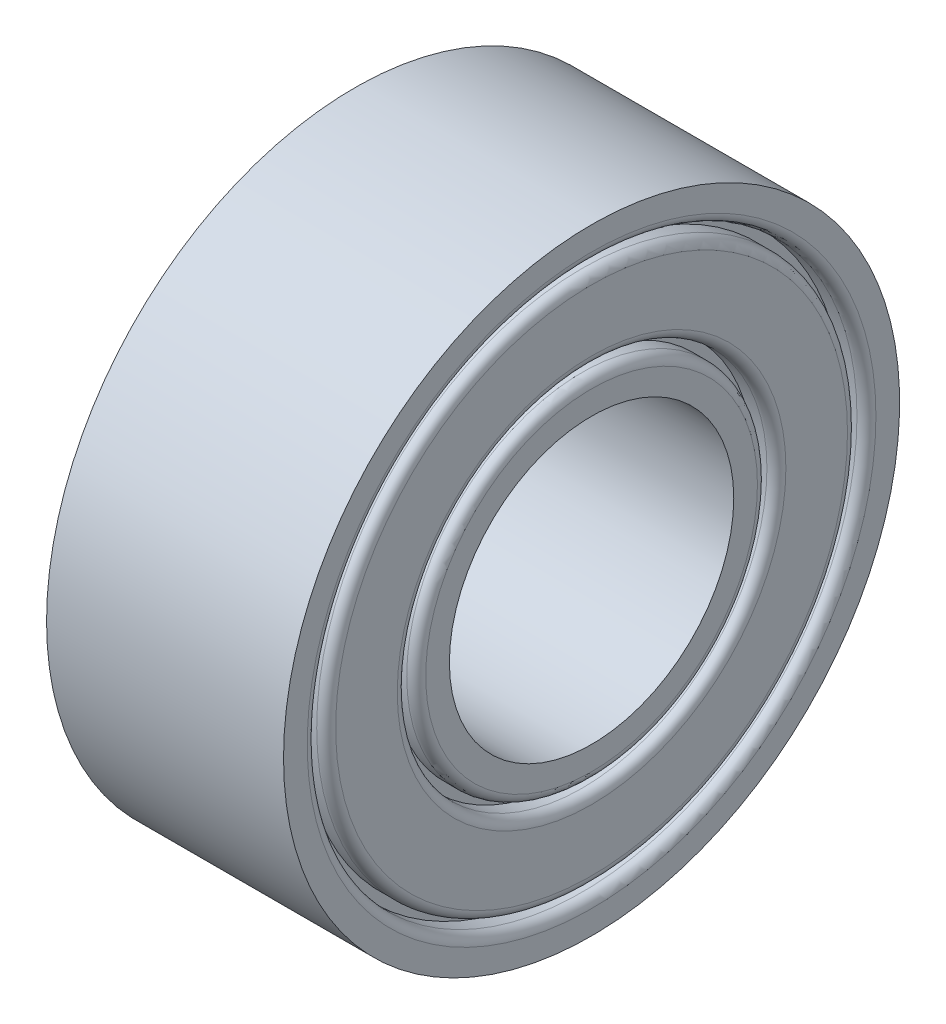
ISO-10303-21;
HEADER;
FILE_DESCRIPTION(('STEP AP214'),'2;1');
FILE_NAME('part.step','',(''),(''),'','','');
FILE_SCHEMA(('AUTOMOTIVE_DESIGN { 1 0 10303 214 1 1 1 1 }'));
ENDSEC;
DATA;
#1=APPLICATION_CONTEXT('core data for automotive mechanical design processes');
#2=APPLICATION_PROTOCOL_DEFINITION('international standard','automotive_design',2000,#1);
#3=PRODUCT_CONTEXT('',#1,'mechanical');
#4=PRODUCT('Part','Part','',(#3));
#5=PRODUCT_RELATED_PRODUCT_CATEGORY('part','',(#4));
#6=PRODUCT_DEFINITION_FORMATION('','',#4);
#7=PRODUCT_DEFINITION_CONTEXT('part definition',#1,'design');
#8=PRODUCT_DEFINITION('design','',#6,#7);
#9=PRODUCT_DEFINITION_SHAPE('','',#8);
#10=(LENGTH_UNIT() NAMED_UNIT(*) SI_UNIT(.MILLI.,.METRE.));
#11=(NAMED_UNIT(*) PLANE_ANGLE_UNIT() SI_UNIT($,.RADIAN.));
#12=(NAMED_UNIT(*) SI_UNIT($,.STERADIAN.) SOLID_ANGLE_UNIT());
#13=UNCERTAINTY_MEASURE_WITH_UNIT(LENGTH_MEASURE(1.E-05),#10,'distance_accuracy_value','');
#14=(GEOMETRIC_REPRESENTATION_CONTEXT(3) GLOBAL_UNCERTAINTY_ASSIGNED_CONTEXT((#13)) GLOBAL_UNIT_ASSIGNED_CONTEXT((#10,
#11,#12)) REPRESENTATION_CONTEXT('',''));
#15=CARTESIAN_POINT('',(0.,0.,0.));
#16=DIRECTION('',(0.,0.,1.));
#17=DIRECTION('',(1.,0.,0.));
#18=AXIS2_PLACEMENT_3D('',#15,#16,#17);
#19=CARTESIAN_POINT('',(2.5,0.,0.));
#20=DIRECTION('',(-1.,0.,0.));
#21=DIRECTION('',(0.,0.,1.));
#22=AXIS2_PLACEMENT_3D('',#19,#20,#21);
#23=CYLINDRICAL_SURFACE('',#22,3.);
#24=CARTESIAN_POINT('',(-2.5,0.,0.));
#25=DIRECTION('',(-1.,0.,0.));
#26=DIRECTION('',(0.,0.,1.));
#27=AXIS2_PLACEMENT_3D('',#24,#25,#26);
#28=CIRCLE('',#27,3.);
#29=CARTESIAN_POINT('',(-2.5,0.,3.));
#30=VERTEX_POINT('',#29);
#31=EDGE_CURVE('E17',#30,#30,#28,.F.);
#32=ORIENTED_EDGE('',*,*,#31,.F.);
#33=EDGE_LOOP('',(#32));
#34=FACE_BOUND('',#33,.T.);
#35=CARTESIAN_POINT('',(2.5,0.,0.));
#36=DIRECTION('',(-1.,0.,0.));
#37=DIRECTION('',(0.,0.,1.));
#38=AXIS2_PLACEMENT_3D('',#35,#36,#37);
#39=CIRCLE('',#38,3.);
#40=CARTESIAN_POINT('',(2.5,0.,3.));
#41=VERTEX_POINT('',#40);
#42=EDGE_CURVE('E61',#41,#41,#39,.T.);
#43=ORIENTED_EDGE('',*,*,#42,.F.);
#44=EDGE_LOOP('',(#43));
#45=FACE_BOUND('',#44,.T.);
#46=ADVANCED_FACE('F14',(#34,#45),#23,.F.);
#47=CARTESIAN_POINT('',(-2.5,3.5,0.));
#48=DIRECTION('',(-1.,0.,0.));
#49=DIRECTION('',(0.,0.,1.));
#50=AXIS2_PLACEMENT_3D('',#47,#48,#49);
#51=PLANE('',#50);
#52=CARTESIAN_POINT('',(-2.5,0.,0.));
#53=DIRECTION('',(1.,0.,0.));
#54=DIRECTION('',(0.,0.,-1.));
#55=AXIS2_PLACEMENT_3D('',#52,#53,#54);
#56=CIRCLE('',#55,3.50000000298023);
#57=CARTESIAN_POINT('',(-2.5,0.,-3.50000000298023));
#58=VERTEX_POINT('',#57);
#59=EDGE_CURVE('E63',#58,#58,#56,.T.);
#60=ORIENTED_EDGE('',*,*,#59,.F.);
#61=EDGE_LOOP('',(#60));
#62=FACE_BOUND('',#61,.T.);
#63=ORIENTED_EDGE('',*,*,#31,.T.);
#64=EDGE_LOOP('',(#63));
#65=FACE_BOUND('',#64,.T.);
#66=ADVANCED_FACE('F71',(#62,#65),#51,.T.);
#67=CARTESIAN_POINT('',(2.5,3.,0.));
#68=DIRECTION('',(1.,0.,0.));
#69=DIRECTION('',(0.,0.,-1.));
#70=AXIS2_PLACEMENT_3D('',#67,#68,#69);
#71=PLANE('',#70);
#72=ORIENTED_EDGE('',*,*,#42,.T.);
#73=EDGE_LOOP('',(#72));
#74=FACE_BOUND('',#73,.T.);
#75=CARTESIAN_POINT('',(2.5,0.,0.));
#76=DIRECTION('',(-1.,0.,0.));
#77=DIRECTION('',(0.,0.,-1.));
#78=AXIS2_PLACEMENT_3D('',#75,#76,#77);
#79=CIRCLE('',#78,3.5);
#80=CARTESIAN_POINT('',(2.5,0.,-3.5));
#81=VERTEX_POINT('',#80);
#82=EDGE_CURVE('E67',#81,#81,#79,.T.);
#83=ORIENTED_EDGE('',*,*,#82,.F.);
#84=EDGE_LOOP('',(#83));
#85=FACE_BOUND('',#84,.T.);
#86=ADVANCED_FACE('F79',(#74,#85),#71,.T.);
#87=CARTESIAN_POINT('',(-2.3,0.,0.));
#88=DIRECTION('',(1.,0.,0.));
#89=DIRECTION('',(0.,0.,-1.));
#90=AXIS2_PLACEMENT_3D('',#87,#88,#89);
#91=TOROIDAL_SURFACE('',#90,3.5,0.2);
#92=CARTESIAN_POINT('',(-2.3,0.,0.));
#93=DIRECTION('',(-1.,0.,0.));
#94=DIRECTION('',(0.,0.,1.));
#95=AXIS2_PLACEMENT_3D('',#92,#93,#94);
#96=CIRCLE('',#95,3.7);
#97=CARTESIAN_POINT('',(-2.3,0.,3.7));
#98=VERTEX_POINT('',#97);
#99=EDGE_CURVE('E286',#98,#98,#96,.F.);
#100=ORIENTED_EDGE('',*,*,#99,.F.);
#101=EDGE_LOOP('',(#100));
#102=FACE_BOUND('',#101,.T.);
#103=ORIENTED_EDGE('',*,*,#59,.T.);
#104=EDGE_LOOP('',(#103));
#105=FACE_BOUND('',#104,.T.);
#106=ADVANCED_FACE('F303',(#102,#105),#91,.T.);
#107=CARTESIAN_POINT('',(2.3,0.,0.));
#108=DIRECTION('',(1.,0.,0.));
#109=DIRECTION('',(0.,0.,-1.));
#110=AXIS2_PLACEMENT_3D('',#107,#108,#109);
#111=TOROIDAL_SURFACE('',#110,3.5,0.2);
#112=ORIENTED_EDGE('',*,*,#82,.T.);
#113=EDGE_LOOP('',(#112));
#114=FACE_BOUND('',#113,.T.);
#115=CARTESIAN_POINT('',(2.3,0.,0.));
#116=DIRECTION('',(-1.,0.,0.));
#117=DIRECTION('',(0.,0.,1.));
#118=AXIS2_PLACEMENT_3D('',#115,#116,#117);
#119=CIRCLE('',#118,3.7);
#120=CARTESIAN_POINT('',(2.3,0.,3.7));
#121=VERTEX_POINT('',#120);
#122=EDGE_CURVE('E60',#121,#121,#119,.T.);
#123=ORIENTED_EDGE('',*,*,#122,.F.);
#124=EDGE_LOOP('',(#123));
#125=FACE_BOUND('',#124,.T.);
#126=ADVANCED_FACE('F298',(#114,#125),#111,.T.);
#127=CARTESIAN_POINT('',(2.5,0.,0.));
#128=DIRECTION('',(-1.,0.,0.));
#129=DIRECTION('',(0.,0.,1.));
#130=AXIS2_PLACEMENT_3D('',#127,#128,#129);
#131=CYLINDRICAL_SURFACE('',#130,3.7);
#132=CARTESIAN_POINT('',(-2.,0.,0.));
#133=DIRECTION('',(-1.,0.,0.));
#134=DIRECTION('',(0.,0.,1.));
#135=AXIS2_PLACEMENT_3D('',#132,#133,#134);
#136=CIRCLE('',#135,3.7);
#137=CARTESIAN_POINT('',(-2.,0.,3.7));
#138=VERTEX_POINT('',#137);
#139=EDGE_CURVE('E58',#138,#138,#136,.F.);
#140=ORIENTED_EDGE('',*,*,#139,.F.);
#141=EDGE_LOOP('',(#140));
#142=FACE_BOUND('',#141,.T.);
#143=ORIENTED_EDGE('',*,*,#99,.T.);
#144=EDGE_LOOP('',(#143));
#145=FACE_BOUND('',#144,.T.);
#146=ADVANCED_FACE('F302',(#142,#145),#131,.T.);
#147=CARTESIAN_POINT('',(2.5,0.,0.));
#148=DIRECTION('',(-1.,0.,0.));
#149=DIRECTION('',(0.,0.,1.));
#150=AXIS2_PLACEMENT_3D('',#147,#148,#149);
#151=CYLINDRICAL_SURFACE('',#150,3.7);
#152=ORIENTED_EDGE('',*,*,#122,.T.);
#153=EDGE_LOOP('',(#152));
#154=FACE_BOUND('',#153,.T.);
#155=CARTESIAN_POINT('',(2.,0.,0.));
#156=DIRECTION('',(-1.,0.,0.));
#157=DIRECTION('',(0.,0.,1.));
#158=AXIS2_PLACEMENT_3D('',#155,#156,#157);
#159=CIRCLE('',#158,3.7);
#160=CARTESIAN_POINT('',(2.,0.,3.7));
#161=VERTEX_POINT('',#160);
#162=EDGE_CURVE('E55',#161,#161,#159,.T.);
#163=ORIENTED_EDGE('',*,*,#162,.F.);
#164=EDGE_LOOP('',(#163));
#165=FACE_BOUND('',#164,.T.);
#166=ADVANCED_FACE('F344',(#154,#165),#151,.T.);
#167=CARTESIAN_POINT('',(-2.,3.9,0.));
#168=DIRECTION('',(-1.,0.,0.));
#169=DIRECTION('',(0.,0.,1.));
#170=AXIS2_PLACEMENT_3D('',#167,#168,#169);
#171=PLANE('',#170);
#172=CARTESIAN_POINT('',(-2.,0.,0.));
#173=DIRECTION('',(-1.,0.,0.));
#174=DIRECTION('',(0.,0.,1.));
#175=AXIS2_PLACEMENT_3D('',#172,#173,#174);
#176=CIRCLE('',#175,3.9);
#177=CARTESIAN_POINT('',(-2.,0.,3.9));
#178=VERTEX_POINT('',#177);
#179=EDGE_CURVE('E52',#178,#178,#176,.T.);
#180=ORIENTED_EDGE('',*,*,#179,.T.);
#181=EDGE_LOOP('',(#180));
#182=FACE_BOUND('',#181,.T.);
#183=ORIENTED_EDGE('',*,*,#139,.T.);
#184=EDGE_LOOP('',(#183));
#185=FACE_BOUND('',#184,.T.);
#186=ADVANCED_FACE('F347',(#182,#185),#171,.T.);
#187=CARTESIAN_POINT('',(2.,3.7,0.));
#188=DIRECTION('',(1.,0.,0.));
#189=DIRECTION('',(0.,0.,-1.));
#190=AXIS2_PLACEMENT_3D('',#187,#188,#189);
#191=PLANE('',#190);
#192=ORIENTED_EDGE('',*,*,#162,.T.);
#193=EDGE_LOOP('',(#192));
#194=FACE_BOUND('',#193,.T.);
#195=CARTESIAN_POINT('',(2.,0.,0.));
#196=DIRECTION('',(-1.,0.,0.));
#197=DIRECTION('',(0.,0.,1.));
#198=AXIS2_PLACEMENT_3D('',#195,#196,#197);
#199=CIRCLE('',#198,3.9);
#200=CARTESIAN_POINT('',(2.,0.,3.9));
#201=VERTEX_POINT('',#200);
#202=EDGE_CURVE('E48',#201,#201,#199,.F.);
#203=ORIENTED_EDGE('',*,*,#202,.T.);
#204=EDGE_LOOP('',(#203));
#205=FACE_BOUND('',#204,.T.);
#206=ADVANCED_FACE('F350',(#194,#205),#191,.T.);
#207=CARTESIAN_POINT('',(2.5,0.,0.));
#208=DIRECTION('',(-1.,0.,0.));
#209=DIRECTION('',(0.,0.,1.));
#210=AXIS2_PLACEMENT_3D('',#207,#208,#209);
#211=CYLINDRICAL_SURFACE('',#210,3.9);
#212=CARTESIAN_POINT('',(-2.3,0.,0.));
#213=DIRECTION('',(1.,0.,0.));
#214=DIRECTION('',(0.,0.,-1.));
#215=AXIS2_PLACEMENT_3D('',#212,#213,#214);
#216=CIRCLE('',#215,3.9);
#217=CARTESIAN_POINT('',(-2.3,0.,-3.9));
#218=VERTEX_POINT('',#217);
#219=EDGE_CURVE('E51',#218,#218,#216,.T.);
#220=ORIENTED_EDGE('',*,*,#219,.F.);
#221=EDGE_LOOP('',(#220));
#222=FACE_BOUND('',#221,.T.);
#223=ORIENTED_EDGE('',*,*,#179,.F.);
#224=EDGE_LOOP('',(#223));
#225=FACE_BOUND('',#224,.T.);
#226=ADVANCED_FACE('F353',(#222,#225),#211,.F.);
#227=CARTESIAN_POINT('',(2.5,0.,0.));
#228=DIRECTION('',(-1.,0.,0.));
#229=DIRECTION('',(0.,0.,1.));
#230=AXIS2_PLACEMENT_3D('',#227,#228,#229);
#231=CYLINDRICAL_SURFACE('',#230,3.9);
#232=ORIENTED_EDGE('',*,*,#202,.F.);
#233=EDGE_LOOP('',(#232));
#234=FACE_BOUND('',#233,.T.);
#235=CARTESIAN_POINT('',(2.3,0.,0.));
#236=DIRECTION('',(1.,0.,0.));
#237=DIRECTION('',(0.,0.,-1.));
#238=AXIS2_PLACEMENT_3D('',#235,#236,#237);
#239=CIRCLE('',#238,3.9);
#240=CARTESIAN_POINT('',(2.3,0.,-3.9));
#241=VERTEX_POINT('',#240);
#242=EDGE_CURVE('E246',#241,#241,#239,.F.);
#243=ORIENTED_EDGE('',*,*,#242,.F.);
#244=EDGE_LOOP('',(#243));
#245=FACE_BOUND('',#244,.T.);
#246=ADVANCED_FACE('F271',(#234,#245),#231,.F.);
#247=CARTESIAN_POINT('',(-2.3,0.,0.));
#248=DIRECTION('',(1.,0.,0.));
#249=DIRECTION('',(0.,0.,-1.));
#250=AXIS2_PLACEMENT_3D('',#247,#248,#249);
#251=TOROIDAL_SURFACE('',#250,4.1,0.200000000000001);
#252=CARTESIAN_POINT('',(-2.5,0.,0.));
#253=DIRECTION('',(-1.,0.,0.));
#254=DIRECTION('',(0.,0.,-1.));
#255=AXIS2_PLACEMENT_3D('',#252,#253,#254);
#256=CIRCLE('',#255,4.1);
#257=CARTESIAN_POINT('',(-2.5,0.,-4.1));
#258=VERTEX_POINT('',#257);
#259=EDGE_CURVE('E201',#258,#258,#256,.F.);
#260=ORIENTED_EDGE('',*,*,#259,.F.);
#261=EDGE_LOOP('',(#260));
#262=FACE_BOUND('',#261,.T.);
#263=ORIENTED_EDGE('',*,*,#219,.T.);
#264=EDGE_LOOP('',(#263));
#265=FACE_BOUND('',#264,.T.);
#266=ADVANCED_FACE('F267',(#262,#265),#251,.T.);
#267=CARTESIAN_POINT('',(2.3,0.,0.));
#268=DIRECTION('',(1.,0.,0.));
#269=DIRECTION('',(0.,0.,-1.));
#270=AXIS2_PLACEMENT_3D('',#267,#268,#269);
#271=TOROIDAL_SURFACE('',#270,4.1,0.200000000000001);
#272=ORIENTED_EDGE('',*,*,#242,.T.);
#273=EDGE_LOOP('',(#272));
#274=FACE_BOUND('',#273,.T.);
#275=CARTESIAN_POINT('',(2.5,0.,0.));
#276=DIRECTION('',(1.,0.,0.));
#277=DIRECTION('',(0.,0.,-1.));
#278=AXIS2_PLACEMENT_3D('',#275,#276,#277);
#279=CIRCLE('',#278,4.1);
#280=CARTESIAN_POINT('',(2.5,0.,-4.1));
#281=VERTEX_POINT('',#280);
#282=EDGE_CURVE('E255',#281,#281,#279,.F.);
#283=ORIENTED_EDGE('',*,*,#282,.F.);
#284=EDGE_LOOP('',(#283));
#285=FACE_BOUND('',#284,.T.);
#286=ADVANCED_FACE('F218',(#274,#285),#271,.T.);
#287=CARTESIAN_POINT('',(-2.5,5.4,0.));
#288=DIRECTION('',(-1.,0.,0.));
#289=DIRECTION('',(0.,0.,1.));
#290=AXIS2_PLACEMENT_3D('',#287,#288,#289);
#291=PLANE('',#290);
#292=CARTESIAN_POINT('',(-2.5,0.,0.));
#293=DIRECTION('',(1.,0.,0.));
#294=DIRECTION('',(0.,0.,-1.));
#295=AXIS2_PLACEMENT_3D('',#292,#293,#294);
#296=CIRCLE('',#295,5.4);
#297=CARTESIAN_POINT('',(-2.5,0.,-5.4));
#298=VERTEX_POINT('',#297);
#299=EDGE_CURVE('E236',#298,#298,#296,.T.);
#300=ORIENTED_EDGE('',*,*,#299,.F.);
#301=EDGE_LOOP('',(#300));
#302=FACE_BOUND('',#301,.T.);
#303=ORIENTED_EDGE('',*,*,#259,.T.);
#304=EDGE_LOOP('',(#303));
#305=FACE_BOUND('',#304,.T.);
#306=ADVANCED_FACE('F208',(#302,#305),#291,.T.);
#307=CARTESIAN_POINT('',(2.5,4.1,0.));
#308=DIRECTION('',(1.,0.,0.));
#309=DIRECTION('',(0.,0.,-1.));
#310=AXIS2_PLACEMENT_3D('',#307,#308,#309);
#311=PLANE('',#310);
#312=ORIENTED_EDGE('',*,*,#282,.T.);
#313=EDGE_LOOP('',(#312));
#314=FACE_BOUND('',#313,.T.);
#315=CARTESIAN_POINT('',(2.5,0.,0.));
#316=DIRECTION('',(-1.,0.,0.));
#317=DIRECTION('',(0.,0.,-1.));
#318=AXIS2_PLACEMENT_3D('',#315,#316,#317);
#319=CIRCLE('',#318,5.4);
#320=CARTESIAN_POINT('',(2.5,0.,-5.4));
#321=VERTEX_POINT('',#320);
#322=EDGE_CURVE('E166',#321,#321,#319,.T.);
#323=ORIENTED_EDGE('',*,*,#322,.F.);
#324=EDGE_LOOP('',(#323));
#325=FACE_BOUND('',#324,.T.);
#326=ADVANCED_FACE('F217',(#314,#325),#311,.T.);
#327=CARTESIAN_POINT('',(-2.3,0.,0.));
#328=DIRECTION('',(1.,0.,0.));
#329=DIRECTION('',(0.,0.,-1.));
#330=AXIS2_PLACEMENT_3D('',#327,#328,#329);
#331=TOROIDAL_SURFACE('',#330,5.4,0.200000000000001);
#332=CARTESIAN_POINT('',(-2.3,0.,0.));
#333=DIRECTION('',(-1.,0.,0.));
#334=DIRECTION('',(0.,0.,1.));
#335=AXIS2_PLACEMENT_3D('',#332,#333,#334);
#336=CIRCLE('',#335,5.6);
#337=CARTESIAN_POINT('',(-2.3,0.,5.6));
#338=VERTEX_POINT('',#337);
#339=EDGE_CURVE('E161',#338,#338,#336,.F.);
#340=ORIENTED_EDGE('',*,*,#339,.F.);
#341=EDGE_LOOP('',(#340));
#342=FACE_BOUND('',#341,.T.);
#343=ORIENTED_EDGE('',*,*,#299,.T.);
#344=EDGE_LOOP('',(#343));
#345=FACE_BOUND('',#344,.T.);
#346=ADVANCED_FACE('F180',(#342,#345),#331,.T.);
#347=CARTESIAN_POINT('',(2.3,0.,0.));
#348=DIRECTION('',(1.,0.,0.));
#349=DIRECTION('',(0.,0.,-1.));
#350=AXIS2_PLACEMENT_3D('',#347,#348,#349);
#351=TOROIDAL_SURFACE('',#350,5.4,0.200000000000001);
#352=ORIENTED_EDGE('',*,*,#322,.T.);
#353=EDGE_LOOP('',(#352));
#354=FACE_BOUND('',#353,.T.);
#355=CARTESIAN_POINT('',(2.3,0.,0.));
#356=DIRECTION('',(-1.,0.,0.));
#357=DIRECTION('',(0.,0.,1.));
#358=AXIS2_PLACEMENT_3D('',#355,#356,#357);
#359=CIRCLE('',#358,5.6);
#360=CARTESIAN_POINT('',(2.3,0.,5.6));
#361=VERTEX_POINT('',#360);
#362=EDGE_CURVE('E47',#361,#361,#359,.T.);
#363=ORIENTED_EDGE('',*,*,#362,.F.);
#364=EDGE_LOOP('',(#363));
#365=FACE_BOUND('',#364,.T.);
#366=ADVANCED_FACE('F174',(#354,#365),#351,.T.);
#367=CARTESIAN_POINT('',(2.5,0.,0.));
#368=DIRECTION('',(-1.,0.,0.));
#369=DIRECTION('',(0.,0.,1.));
#370=AXIS2_PLACEMENT_3D('',#367,#368,#369);
#371=CYLINDRICAL_SURFACE('',#370,5.6);
#372=CARTESIAN_POINT('',(-2.,0.,0.));
#373=DIRECTION('',(-1.,0.,0.));
#374=DIRECTION('',(0.,0.,1.));
#375=AXIS2_PLACEMENT_3D('',#372,#373,#374);
#376=CIRCLE('',#375,5.6);
#377=CARTESIAN_POINT('',(-2.,0.,5.6));
#378=VERTEX_POINT('',#377);
#379=EDGE_CURVE('E44',#378,#378,#376,.F.);
#380=ORIENTED_EDGE('',*,*,#379,.F.);
#381=EDGE_LOOP('',(#380));
#382=FACE_BOUND('',#381,.T.);
#383=ORIENTED_EDGE('',*,*,#339,.T.);
#384=EDGE_LOOP('',(#383));
#385=FACE_BOUND('',#384,.T.);
#386=ADVANCED_FACE('F179',(#382,#385),#371,.T.);
#387=CARTESIAN_POINT('',(2.5,0.,0.));
#388=DIRECTION('',(-1.,0.,0.));
#389=DIRECTION('',(0.,0.,1.));
#390=AXIS2_PLACEMENT_3D('',#387,#388,#389);
#391=CYLINDRICAL_SURFACE('',#390,5.6);
#392=ORIENTED_EDGE('',*,*,#362,.T.);
#393=EDGE_LOOP('',(#392));
#394=FACE_BOUND('',#393,.T.);
#395=CARTESIAN_POINT('',(2.,0.,0.));
#396=DIRECTION('',(-1.,0.,0.));
#397=DIRECTION('',(0.,0.,1.));
#398=AXIS2_PLACEMENT_3D('',#395,#396,#397);
#399=CIRCLE('',#398,5.6);
#400=CARTESIAN_POINT('',(2.,0.,5.6));
#401=VERTEX_POINT('',#400);
#402=EDGE_CURVE('E41',#401,#401,#399,.T.);
#403=ORIENTED_EDGE('',*,*,#402,.F.);
#404=EDGE_LOOP('',(#403));
#405=FACE_BOUND('',#404,.T.);
#406=ADVANCED_FACE('F394',(#394,#405),#391,.T.);
#407=CARTESIAN_POINT('',(-2.,5.8,0.));
#408=DIRECTION('',(-1.,0.,0.));
#409=DIRECTION('',(0.,0.,1.));
#410=AXIS2_PLACEMENT_3D('',#407,#408,#409);
#411=PLANE('',#410);
#412=CARTESIAN_POINT('',(-2.,0.,0.));
#413=DIRECTION('',(-1.,0.,0.));
#414=DIRECTION('',(0.,0.,1.));
#415=AXIS2_PLACEMENT_3D('',#412,#413,#414);
#416=CIRCLE('',#415,5.8);
#417=CARTESIAN_POINT('',(-2.,0.,5.8));
#418=VERTEX_POINT('',#417);
#419=EDGE_CURVE('E38',#418,#418,#416,.T.);
#420=ORIENTED_EDGE('',*,*,#419,.T.);
#421=EDGE_LOOP('',(#420));
#422=FACE_BOUND('',#421,.T.);
#423=ORIENTED_EDGE('',*,*,#379,.T.);
#424=EDGE_LOOP('',(#423));
#425=FACE_BOUND('',#424,.T.);
#426=ADVANCED_FACE('F401',(#422,#425),#411,.T.);
#427=CARTESIAN_POINT('',(2.,5.6,0.));
#428=DIRECTION('',(1.,0.,0.));
#429=DIRECTION('',(0.,0.,-1.));
#430=AXIS2_PLACEMENT_3D('',#427,#428,#429);
#431=PLANE('',#430);
#432=ORIENTED_EDGE('',*,*,#402,.T.);
#433=EDGE_LOOP('',(#432));
#434=FACE_BOUND('',#433,.T.);
#435=CARTESIAN_POINT('',(2.,0.,0.));
#436=DIRECTION('',(-1.,0.,0.));
#437=DIRECTION('',(0.,0.,1.));
#438=AXIS2_PLACEMENT_3D('',#435,#436,#437);
#439=CIRCLE('',#438,5.8);
#440=CARTESIAN_POINT('',(2.,0.,5.8));
#441=VERTEX_POINT('',#440);
#442=EDGE_CURVE('E34',#441,#441,#439,.F.);
#443=ORIENTED_EDGE('',*,*,#442,.T.);
#444=EDGE_LOOP('',(#443));
#445=FACE_BOUND('',#444,.T.);
#446=ADVANCED_FACE('F408',(#434,#445),#431,.T.);
#447=CARTESIAN_POINT('',(2.5,0.,0.));
#448=DIRECTION('',(-1.,0.,0.));
#449=DIRECTION('',(0.,0.,1.));
#450=AXIS2_PLACEMENT_3D('',#447,#448,#449);
#451=CYLINDRICAL_SURFACE('',#450,5.8);
#452=CARTESIAN_POINT('',(-2.3,0.,0.));
#453=DIRECTION('',(1.,0.,0.));
#454=DIRECTION('',(0.,0.,-1.));
#455=AXIS2_PLACEMENT_3D('',#452,#453,#454);
#456=CIRCLE('',#455,5.8);
#457=CARTESIAN_POINT('',(-2.3,0.,-5.8));
#458=VERTEX_POINT('',#457);
#459=EDGE_CURVE('E37',#458,#458,#456,.T.);
#460=ORIENTED_EDGE('',*,*,#459,.F.);
#461=EDGE_LOOP('',(#460));
#462=FACE_BOUND('',#461,.T.);
#463=ORIENTED_EDGE('',*,*,#419,.F.);
#464=EDGE_LOOP('',(#463));
#465=FACE_BOUND('',#464,.T.);
#466=ADVANCED_FACE('F416',(#462,#465),#451,.F.);
#467=CARTESIAN_POINT('',(2.5,0.,0.));
#468=DIRECTION('',(-1.,0.,0.));
#469=DIRECTION('',(0.,0.,1.));
#470=AXIS2_PLACEMENT_3D('',#467,#468,#469);
#471=CYLINDRICAL_SURFACE('',#470,5.8);
#472=ORIENTED_EDGE('',*,*,#442,.F.);
#473=EDGE_LOOP('',(#472));
#474=FACE_BOUND('',#473,.T.);
#475=CARTESIAN_POINT('',(2.3,0.,0.));
#476=DIRECTION('',(1.,0.,0.));
#477=DIRECTION('',(0.,0.,-1.));
#478=AXIS2_PLACEMENT_3D('',#475,#476,#477);
#479=CIRCLE('',#478,5.8);
#480=CARTESIAN_POINT('',(2.3,0.,-5.8));
#481=VERTEX_POINT('',#480);
#482=EDGE_CURVE('E122',#481,#481,#479,.F.);
#483=ORIENTED_EDGE('',*,*,#482,.F.);
#484=EDGE_LOOP('',(#483));
#485=FACE_BOUND('',#484,.T.);
#486=ADVANCED_FACE('F424',(#474,#485),#471,.F.);
#487=CARTESIAN_POINT('',(-2.3,0.,0.));
#488=DIRECTION('',(1.,0.,0.));
#489=DIRECTION('',(0.,0.,-1.));
#490=AXIS2_PLACEMENT_3D('',#487,#488,#489);
#491=TOROIDAL_SURFACE('',#490,6.,0.200000000000002);
#492=CARTESIAN_POINT('',(-2.5,0.,0.));
#493=DIRECTION('',(-1.,0.,0.));
#494=DIRECTION('',(0.,0.,-1.));
#495=AXIS2_PLACEMENT_3D('',#492,#493,#494);
#496=CIRCLE('',#495,6.);
#497=CARTESIAN_POINT('',(-2.5,0.,-6.));
#498=VERTEX_POINT('',#497);
#499=EDGE_CURVE('E111',#498,#498,#496,.F.);
#500=ORIENTED_EDGE('',*,*,#499,.F.);
#501=EDGE_LOOP('',(#500));
#502=FACE_BOUND('',#501,.T.);
#503=ORIENTED_EDGE('',*,*,#459,.T.);
#504=EDGE_LOOP('',(#503));
#505=FACE_BOUND('',#504,.T.);
#506=ADVANCED_FACE('F128',(#502,#505),#491,.T.);
#507=CARTESIAN_POINT('',(2.3,0.,0.));
#508=DIRECTION('',(1.,0.,0.));
#509=DIRECTION('',(0.,0.,-1.));
#510=AXIS2_PLACEMENT_3D('',#507,#508,#509);
#511=TOROIDAL_SURFACE('',#510,6.,0.200000000000002);
#512=ORIENTED_EDGE('',*,*,#482,.T.);
#513=EDGE_LOOP('',(#512));
#514=FACE_BOUND('',#513,.T.);
#515=CARTESIAN_POINT('',(2.5,0.,0.));
#516=DIRECTION('',(1.,0.,0.));
#517=DIRECTION('',(0.,0.,-1.));
#518=AXIS2_PLACEMENT_3D('',#515,#516,#517);
#519=CIRCLE('',#518,6.);
#520=CARTESIAN_POINT('',(2.5,0.,-6.));
#521=VERTEX_POINT('',#520);
#522=EDGE_CURVE('E26',#521,#521,#519,.F.);
#523=ORIENTED_EDGE('',*,*,#522,.F.);
#524=EDGE_LOOP('',(#523));
#525=FACE_BOUND('',#524,.T.);
#526=ADVANCED_FACE('F124',(#514,#525),#511,.T.);
#527=CARTESIAN_POINT('',(-2.5,6.5,0.));
#528=DIRECTION('',(-1.,0.,0.));
#529=DIRECTION('',(0.,0.,1.));
#530=AXIS2_PLACEMENT_3D('',#527,#528,#529);
#531=PLANE('',#530);
#532=CARTESIAN_POINT('',(-2.5,0.,0.));
#533=DIRECTION('',(-1.,0.,0.));
#534=DIRECTION('',(0.,0.,1.));
#535=AXIS2_PLACEMENT_3D('',#532,#533,#534);
#536=CIRCLE('',#535,6.5);
#537=CARTESIAN_POINT('',(-2.5,0.,6.5));
#538=VERTEX_POINT('',#537);
#539=EDGE_CURVE('E21',#538,#538,#536,.F.);
#540=ORIENTED_EDGE('',*,*,#539,.F.);
#541=EDGE_LOOP('',(#540));
#542=FACE_BOUND('',#541,.T.);
#543=ORIENTED_EDGE('',*,*,#499,.T.);
#544=EDGE_LOOP('',(#543));
#545=FACE_BOUND('',#544,.T.);
#546=ADVANCED_FACE('F88',(#542,#545),#531,.T.);
#547=CARTESIAN_POINT('',(2.5,6.,0.));
#548=DIRECTION('',(1.,0.,0.));
#549=DIRECTION('',(0.,0.,-1.));
#550=AXIS2_PLACEMENT_3D('',#547,#548,#549);
#551=PLANE('',#550);
#552=ORIENTED_EDGE('',*,*,#522,.T.);
#553=EDGE_LOOP('',(#552));
#554=FACE_BOUND('',#553,.T.);
#555=CARTESIAN_POINT('',(2.5,0.,0.));
#556=DIRECTION('',(-1.,0.,0.));
#557=DIRECTION('',(0.,0.,1.));
#558=AXIS2_PLACEMENT_3D('',#555,#556,#557);
#559=CIRCLE('',#558,6.5);
#560=CARTESIAN_POINT('',(2.5,0.,6.5));
#561=VERTEX_POINT('',#560);
#562=EDGE_CURVE('E10',#561,#561,#559,.T.);
#563=ORIENTED_EDGE('',*,*,#562,.F.);
#564=EDGE_LOOP('',(#563));
#565=FACE_BOUND('',#564,.T.);
#566=ADVANCED_FACE('F83',(#554,#565),#551,.T.);
#567=CARTESIAN_POINT('',(2.5,0.,0.));
#568=DIRECTION('',(-1.,0.,0.));
#569=DIRECTION('',(0.,0.,1.));
#570=AXIS2_PLACEMENT_3D('',#567,#568,#569);
#571=CYLINDRICAL_SURFACE('',#570,6.5);
#572=ORIENTED_EDGE('',*,*,#562,.T.);
#573=EDGE_LOOP('',(#572));
#574=FACE_BOUND('',#573,.T.);
#575=ORIENTED_EDGE('',*,*,#539,.T.);
#576=EDGE_LOOP('',(#575));
#577=FACE_BOUND('',#576,.T.);
#578=ADVANCED_FACE('F81',(#574,#577),#571,.T.);
#579=CLOSED_SHELL('',(#46,#66,#86,#106,#126,#146,#166,#186,#206,#226,#246,#266,#286,#306,#326,
#346,#366,#386,#406,#426,#446,#466,#486,#506,#526,#546,#566,#578));
#580=MANIFOLD_SOLID_BREP('B1',#579);
#581=ADVANCED_BREP_SHAPE_REPRESENTATION('',(#18,#580),#14);
#582=SHAPE_DEFINITION_REPRESENTATION(#9,#581);
ENDSEC;
END-ISO-10303-21;
